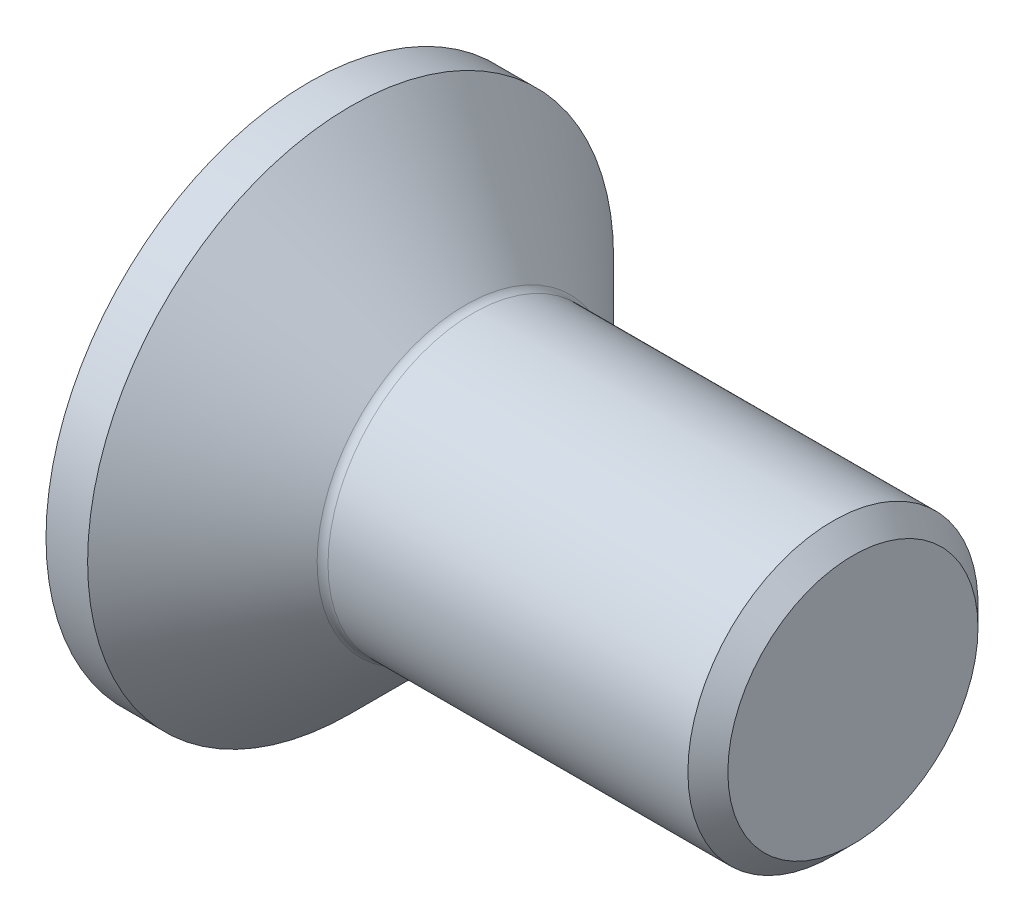
ISO-10303-21;
HEADER;
FILE_DESCRIPTION(('STEP AP214'),'2;1');
FILE_NAME('part.step','',(''),(''),'','','');
FILE_SCHEMA(('AUTOMOTIVE_DESIGN { 1 0 10303 214 1 1 1 1 }'));
ENDSEC;
DATA;
#1=APPLICATION_CONTEXT('core data for automotive mechanical design processes');
#2=APPLICATION_PROTOCOL_DEFINITION('international standard','automotive_design',2000,#1);
#3=PRODUCT_CONTEXT('',#1,'mechanical');
#4=PRODUCT('Part','Part','',(#3));
#5=PRODUCT_RELATED_PRODUCT_CATEGORY('part','',(#4));
#6=PRODUCT_DEFINITION_FORMATION('','',#4);
#7=PRODUCT_DEFINITION_CONTEXT('part definition',#1,'design');
#8=PRODUCT_DEFINITION('design','',#6,#7);
#9=PRODUCT_DEFINITION_SHAPE('','',#8);
#10=(LENGTH_UNIT() NAMED_UNIT(*) SI_UNIT(.MILLI.,.METRE.));
#11=(NAMED_UNIT(*) PLANE_ANGLE_UNIT() SI_UNIT($,.RADIAN.));
#12=(NAMED_UNIT(*) SI_UNIT($,.STERADIAN.) SOLID_ANGLE_UNIT());
#13=UNCERTAINTY_MEASURE_WITH_UNIT(LENGTH_MEASURE(1.E-05),#10,'distance_accuracy_value','');
#14=(GEOMETRIC_REPRESENTATION_CONTEXT(3) GLOBAL_UNCERTAINTY_ASSIGNED_CONTEXT((#13)) GLOBAL_UNIT_ASSIGNED_CONTEXT((#10,
#11,#12)) REPRESENTATION_CONTEXT('',''));
#15=CARTESIAN_POINT('',(0.,0.,0.));
#16=DIRECTION('',(0.,0.,1.));
#17=DIRECTION('',(1.,0.,0.));
#18=AXIS2_PLACEMENT_3D('',#15,#16,#17);
#19=CARTESIAN_POINT('',(0.,0.,0.));
#20=DIRECTION('',(-1.,0.,0.));
#21=DIRECTION('',(0.,0.,1.));
#22=AXIS2_PLACEMENT_3D('',#19,#20,#21);
#23=PLANE('',#22);
#24=CARTESIAN_POINT('',(0.,0.,0.));
#25=DIRECTION('',(-1.,0.,0.));
#26=DIRECTION('',(0.,0.,1.));
#27=AXIS2_PLACEMENT_3D('',#24,#25,#26);
#28=CIRCLE('',#27,14.505);
#29=CARTESIAN_POINT('',(0.,0.,14.505));
#30=VERTEX_POINT('',#29);
#31=EDGE_CURVE('E153',#30,#30,#28,.T.);
#32=ORIENTED_EDGE('',*,*,#31,.T.);
#33=EDGE_LOOP('',(#32));
#34=FACE_BOUND('',#33,.T.);
#35=DIRECTION('',(0.,-0.5,-0.866025403784439));
#36=VECTOR('',#35,1.);
#37=CARTESIAN_POINT('',(0.,-2.88675134594813,5.));
#38=LINE('',#37,#36);
#39=CARTESIAN_POINT('',(0.,-2.88675134594813,5.));
#40=VERTEX_POINT('',#39);
#41=CARTESIAN_POINT('',(0.,-5.77350269189626,0.));
#42=VERTEX_POINT('',#41);
#43=EDGE_CURVE('E119',#40,#42,#38,.T.);
#44=ORIENTED_EDGE('',*,*,#43,.T.);
#45=DIRECTION('',(0.,0.5,-0.866025403784439));
#46=VECTOR('',#45,1.);
#47=CARTESIAN_POINT('',(0.,-5.77350269189626,0.));
#48=LINE('',#47,#46);
#49=CARTESIAN_POINT('',(0.,-2.88675134594813,-5.));
#50=VERTEX_POINT('',#49);
#51=EDGE_CURVE('E50',#42,#50,#48,.T.);
#52=ORIENTED_EDGE('',*,*,#51,.T.);
#53=DIRECTION('',(0.,1.,0.));
#54=VECTOR('',#53,1.);
#55=CARTESIAN_POINT('',(0.,-2.88675134594813,-5.));
#56=LINE('',#55,#54);
#57=CARTESIAN_POINT('',(0.,2.88675134594813,-5.));
#58=VERTEX_POINT('',#57);
#59=EDGE_CURVE('E130',#50,#58,#56,.T.);
#60=ORIENTED_EDGE('',*,*,#59,.T.);
#61=DIRECTION('',(0.,0.5,0.866025403784439));
#62=VECTOR('',#61,1.);
#63=CARTESIAN_POINT('',(0.,2.88675134594813,-5.));
#64=LINE('',#63,#62);
#65=CARTESIAN_POINT('',(0.,5.77350269189626,0.));
#66=VERTEX_POINT('',#65);
#67=EDGE_CURVE('E254',#58,#66,#64,.T.);
#68=ORIENTED_EDGE('',*,*,#67,.T.);
#69=DIRECTION('',(0.,-0.5,0.866025403784439));
#70=VECTOR('',#69,1.);
#71=CARTESIAN_POINT('',(0.,5.77350269189626,0.));
#72=LINE('',#71,#70);
#73=CARTESIAN_POINT('',(0.,2.88675134594813,5.));
#74=VERTEX_POINT('',#73);
#75=EDGE_CURVE('E257',#66,#74,#72,.T.);
#76=ORIENTED_EDGE('',*,*,#75,.T.);
#77=DIRECTION('',(0.,-1.,0.));
#78=VECTOR('',#77,1.);
#79=CARTESIAN_POINT('',(0.,2.88675134594813,5.));
#80=LINE('',#79,#78);
#81=EDGE_CURVE('E260',#74,#40,#80,.T.);
#82=ORIENTED_EDGE('',*,*,#81,.T.);
#83=EDGE_LOOP('',(#44,#52,#60,#68,#76,#82));
#84=FACE_BOUND('',#83,.T.);
#85=ADVANCED_FACE('F35',(#34,#84),#23,.T.);
#86=CARTESIAN_POINT('',(0.,0.,0.));
#87=DIRECTION('',(-1.,0.,0.));
#88=DIRECTION('',(0.,0.,1.));
#89=AXIS2_PLACEMENT_3D('',#86,#87,#88);
#90=CYLINDRICAL_SURFACE('',#89,14.505);
#91=CARTESIAN_POINT('',(2.29500000000003,0.,0.));
#92=DIRECTION('',(-1.,0.,0.));
#93=DIRECTION('',(0.,0.,1.));
#94=AXIS2_PLACEMENT_3D('',#91,#92,#93);
#95=CIRCLE('',#94,14.505);
#96=CARTESIAN_POINT('',(2.29500000000003,0.,14.505));
#97=VERTEX_POINT('',#96);
#98=EDGE_CURVE('E150',#97,#97,#95,.T.);
#99=ORIENTED_EDGE('',*,*,#98,.T.);
#100=EDGE_LOOP('',(#99));
#101=FACE_BOUND('',#100,.T.);
#102=ORIENTED_EDGE('',*,*,#31,.F.);
#103=EDGE_LOOP('',(#102));
#104=FACE_BOUND('',#103,.T.);
#105=ADVANCED_FACE('F174',(#101,#104),#90,.T.);
#106=CARTESIAN_POINT('',(2.29500000000003,0.,0.));
#107=DIRECTION('',(-1.,0.,0.));
#108=DIRECTION('',(0.,0.,1.));
#109=AXIS2_PLACEMENT_3D('',#106,#107,#108);
#110=CONICAL_SURFACE('',#109,14.505,0.78539816339745);
#111=CARTESIAN_POINT('',(8.62426406871193,0.,0.));
#112=DIRECTION('',(-1.,0.,0.));
#113=DIRECTION('',(0.,0.,1.));
#114=AXIS2_PLACEMENT_3D('',#111,#112,#113);
#115=CIRCLE('',#114,8.17573593128808);
#116=CARTESIAN_POINT('',(8.62426406871193,0.,8.17573593128808));
#117=VERTEX_POINT('',#116);
#118=EDGE_CURVE('E43',#117,#117,#115,.T.);
#119=ORIENTED_EDGE('',*,*,#118,.T.);
#120=EDGE_LOOP('',(#119));
#121=FACE_BOUND('',#120,.T.);
#122=ORIENTED_EDGE('',*,*,#98,.F.);
#123=EDGE_LOOP('',(#122));
#124=FACE_BOUND('',#123,.T.);
#125=ADVANCED_FACE('F158',(#121,#124),#110,.T.);
#126=CARTESIAN_POINT('',(0.,0.,0.));
#127=DIRECTION('',(-1.,0.,0.));
#128=DIRECTION('',(0.,0.,1.));
#129=AXIS2_PLACEMENT_3D('',#126,#127,#128);
#130=CYLINDRICAL_SURFACE('',#129,8.);
#131=CARTESIAN_POINT('',(9.04852813742386,0.,0.));
#132=DIRECTION('',(-1.,0.,0.));
#133=DIRECTION('',(0.,0.,1.));
#134=AXIS2_PLACEMENT_3D('',#131,#132,#133);
#135=CIRCLE('',#134,8.);
#136=CARTESIAN_POINT('',(9.04852813742386,0.,8.));
#137=VERTEX_POINT('',#136);
#138=EDGE_CURVE('E11',#137,#137,#135,.F.);
#139=ORIENTED_EDGE('',*,*,#138,.T.);
#140=EDGE_LOOP('',(#139));
#141=FACE_BOUND('',#140,.T.);
#142=CARTESIAN_POINT('',(28.8985,0.,0.));
#143=DIRECTION('',(-1.,0.,0.));
#144=DIRECTION('',(0.,0.,1.));
#145=AXIS2_PLACEMENT_3D('',#142,#143,#144);
#146=CIRCLE('',#145,8.);
#147=CARTESIAN_POINT('',(28.8985,0.,8.));
#148=VERTEX_POINT('',#147);
#149=EDGE_CURVE('E147',#148,#148,#146,.T.);
#150=ORIENTED_EDGE('',*,*,#149,.T.);
#151=EDGE_LOOP('',(#150));
#152=FACE_BOUND('',#151,.T.);
#153=ADVANCED_FACE('F185',(#141,#152),#130,.T.);
#154=CARTESIAN_POINT('',(30.,0.,0.));
#155=DIRECTION('',(-1.,0.,0.));
#156=DIRECTION('',(0.,0.,1.));
#157=AXIS2_PLACEMENT_3D('',#154,#155,#156);
#158=CONICAL_SURFACE('',#157,6.8985,0.78539816339747);
#159=ORIENTED_EDGE('',*,*,#149,.F.);
#160=EDGE_LOOP('',(#159));
#161=FACE_BOUND('',#160,.T.);
#162=CARTESIAN_POINT('',(30.,0.,0.));
#163=DIRECTION('',(-1.,0.,0.));
#164=DIRECTION('',(0.,0.,1.));
#165=AXIS2_PLACEMENT_3D('',#162,#163,#164);
#166=CIRCLE('',#165,6.8985);
#167=CARTESIAN_POINT('',(30.,0.,6.8985));
#168=VERTEX_POINT('',#167);
#169=EDGE_CURVE('E143',#168,#168,#166,.T.);
#170=ORIENTED_EDGE('',*,*,#169,.T.);
#171=EDGE_LOOP('',(#170));
#172=FACE_BOUND('',#171,.T.);
#173=ADVANCED_FACE('F169',(#161,#172),#158,.T.);
#174=CARTESIAN_POINT('',(30.,6.8985,0.));
#175=DIRECTION('',(1.,0.,0.));
#176=DIRECTION('',(0.,0.,-1.));
#177=AXIS2_PLACEMENT_3D('',#174,#175,#176);
#178=PLANE('',#177);
#179=ORIENTED_EDGE('',*,*,#169,.F.);
#180=EDGE_LOOP('',(#179));
#181=FACE_BOUND('',#180,.T.);
#182=ADVANCED_FACE('F162',(#181),#178,.T.);
#183=CARTESIAN_POINT('',(9.04852813742386,0.,0.));
#184=DIRECTION('',(-1.,0.,0.));
#185=DIRECTION('',(0.,0.,1.));
#186=AXIS2_PLACEMENT_3D('',#183,#184,#185);
#187=TOROIDAL_SURFACE('',#186,8.6,0.6);
#188=ORIENTED_EDGE('',*,*,#138,.F.);
#189=EDGE_LOOP('',(#188));
#190=FACE_BOUND('',#189,.T.);
#191=ORIENTED_EDGE('',*,*,#118,.F.);
#192=EDGE_LOOP('',(#191));
#193=FACE_BOUND('',#192,.T.);
#194=ADVANCED_FACE('F37',(#190,#193),#187,.F.);
#195=CARTESIAN_POINT('',(4.8,-5.77350269189626,0.));
#196=DIRECTION('',(0.,0.866025403784439,0.5));
#197=DIRECTION('',(0.,-0.5,0.866025403784439));
#198=AXIS2_PLACEMENT_3D('',#195,#196,#197);
#199=PLANE('',#198);
#200=ORIENTED_EDGE('',*,*,#51,.F.);
#201=DIRECTION('',(-1.,0.,0.));
#202=VECTOR('',#201,1.);
#203=CARTESIAN_POINT('',(4.8,-5.77350269189626,0.));
#204=LINE('',#203,#202);
#205=CARTESIAN_POINT('',(4.8,-5.77350269189626,0.));
#206=VERTEX_POINT('',#205);
#207=EDGE_CURVE('E251',#206,#42,#204,.T.);
#208=ORIENTED_EDGE('',*,*,#207,.F.);
#209=DIRECTION('',(0.,0.5,-0.866025403784439));
#210=VECTOR('',#209,1.);
#211=CARTESIAN_POINT('',(4.8,-5.77350269189626,0.));
#212=LINE('',#211,#210);
#213=CARTESIAN_POINT('',(4.8,-4.33012701892219,-2.5));
#214=VERTEX_POINT('',#213);
#215=EDGE_CURVE('E115',#206,#214,#212,.T.);
#216=ORIENTED_EDGE('',*,*,#215,.T.);
#217=CARTESIAN_POINT('',(4.8,-2.88675134594813,-5.));
#218=VERTEX_POINT('',#217);
#219=EDGE_CURVE('E111',#214,#218,#212,.T.);
#220=ORIENTED_EDGE('',*,*,#219,.T.);
#221=DIRECTION('',(-1.,0.,0.));
#222=VECTOR('',#221,1.);
#223=CARTESIAN_POINT('',(4.8,-2.88675134594813,-5.));
#224=LINE('',#223,#222);
#225=EDGE_CURVE('E113',#218,#50,#224,.T.);
#226=ORIENTED_EDGE('',*,*,#225,.T.);
#227=EDGE_LOOP('',(#200,#208,#216,#220,#226));
#228=FACE_BOUND('',#227,.T.);
#229=ADVANCED_FACE('F112',(#228),#199,.T.);
#230=CARTESIAN_POINT('',(4.8,-2.88675134594813,-5.));
#231=DIRECTION('',(0.,0.,1.));
#232=DIRECTION('',(1.,0.,0.));
#233=AXIS2_PLACEMENT_3D('',#230,#231,#232);
#234=PLANE('',#233);
#235=ORIENTED_EDGE('',*,*,#59,.F.);
#236=ORIENTED_EDGE('',*,*,#225,.F.);
#237=DIRECTION('',(0.,1.,0.));
#238=VECTOR('',#237,1.);
#239=CARTESIAN_POINT('',(4.8,-2.88675134594813,-5.));
#240=LINE('',#239,#238);
#241=CARTESIAN_POINT('',(4.8,0.,-5.));
#242=VERTEX_POINT('',#241);
#243=EDGE_CURVE('E58',#218,#242,#240,.T.);
#244=ORIENTED_EDGE('',*,*,#243,.T.);
#245=CARTESIAN_POINT('',(4.8,2.88675134594813,-5.));
#246=VERTEX_POINT('',#245);
#247=EDGE_CURVE('E125',#242,#246,#240,.T.);
#248=ORIENTED_EDGE('',*,*,#247,.T.);
#249=DIRECTION('',(-1.,0.,0.));
#250=VECTOR('',#249,1.);
#251=CARTESIAN_POINT('',(4.8,2.88675134594813,-5.));
#252=LINE('',#251,#250);
#253=EDGE_CURVE('E132',#246,#58,#252,.T.);
#254=ORIENTED_EDGE('',*,*,#253,.T.);
#255=EDGE_LOOP('',(#235,#236,#244,#248,#254));
#256=FACE_BOUND('',#255,.T.);
#257=ADVANCED_FACE('F127',(#256),#234,.T.);
#258=CARTESIAN_POINT('',(4.8,2.88675134594813,-5.));
#259=DIRECTION('',(0.,-0.866025403784439,0.5));
#260=DIRECTION('',(0.,-0.5,-0.866025403784439));
#261=AXIS2_PLACEMENT_3D('',#258,#259,#260);
#262=PLANE('',#261);
#263=ORIENTED_EDGE('',*,*,#67,.F.);
#264=ORIENTED_EDGE('',*,*,#253,.F.);
#265=DIRECTION('',(0.,0.5,0.866025403784439));
#266=VECTOR('',#265,1.);
#267=CARTESIAN_POINT('',(4.8,2.88675134594813,-5.));
#268=LINE('',#267,#266);
#269=CARTESIAN_POINT('',(4.8,4.33012701892219,-2.5));
#270=VERTEX_POINT('',#269);
#271=EDGE_CURVE('E232',#246,#270,#268,.T.);
#272=ORIENTED_EDGE('',*,*,#271,.T.);
#273=CARTESIAN_POINT('',(4.8,5.77350269189626,0.));
#274=VERTEX_POINT('',#273);
#275=EDGE_CURVE('E124',#270,#274,#268,.T.);
#276=ORIENTED_EDGE('',*,*,#275,.T.);
#277=DIRECTION('',(-1.,0.,0.));
#278=VECTOR('',#277,1.);
#279=CARTESIAN_POINT('',(4.8,5.77350269189626,0.));
#280=LINE('',#279,#278);
#281=EDGE_CURVE('E138',#274,#66,#280,.T.);
#282=ORIENTED_EDGE('',*,*,#281,.T.);
#283=EDGE_LOOP('',(#263,#264,#272,#276,#282));
#284=FACE_BOUND('',#283,.T.);
#285=ADVANCED_FACE('F199',(#284),#262,.T.);
#286=CARTESIAN_POINT('',(4.8,5.77350269189626,0.));
#287=DIRECTION('',(0.,-0.866025403784439,-0.5));
#288=DIRECTION('',(0.,0.5,-0.866025403784439));
#289=AXIS2_PLACEMENT_3D('',#286,#287,#288);
#290=PLANE('',#289);
#291=ORIENTED_EDGE('',*,*,#75,.F.);
#292=ORIENTED_EDGE('',*,*,#281,.F.);
#293=DIRECTION('',(0.,-0.5,0.866025403784439));
#294=VECTOR('',#293,1.);
#295=CARTESIAN_POINT('',(4.8,5.77350269189626,0.));
#296=LINE('',#295,#294);
#297=CARTESIAN_POINT('',(4.8,4.33012701892219,2.5));
#298=VERTEX_POINT('',#297);
#299=EDGE_CURVE('E239',#274,#298,#296,.T.);
#300=ORIENTED_EDGE('',*,*,#299,.T.);
#301=CARTESIAN_POINT('',(4.8,2.88675134594813,5.));
#302=VERTEX_POINT('',#301);
#303=EDGE_CURVE('E237',#298,#302,#296,.T.);
#304=ORIENTED_EDGE('',*,*,#303,.T.);
#305=DIRECTION('',(-1.,0.,0.));
#306=VECTOR('',#305,1.);
#307=CARTESIAN_POINT('',(4.8,2.88675134594813,5.));
#308=LINE('',#307,#306);
#309=EDGE_CURVE('E269',#302,#74,#308,.T.);
#310=ORIENTED_EDGE('',*,*,#309,.T.);
#311=EDGE_LOOP('',(#291,#292,#300,#304,#310));
#312=FACE_BOUND('',#311,.T.);
#313=ADVANCED_FACE('F202',(#312),#290,.T.);
#314=CARTESIAN_POINT('',(4.8,2.88675134594813,5.));
#315=DIRECTION('',(0.,0.,-1.));
#316=DIRECTION('',(0.,1.,0.));
#317=AXIS2_PLACEMENT_3D('',#314,#315,#316);
#318=PLANE('',#317);
#319=ORIENTED_EDGE('',*,*,#81,.F.);
#320=ORIENTED_EDGE('',*,*,#309,.F.);
#321=DIRECTION('',(0.,-1.,0.));
#322=VECTOR('',#321,1.);
#323=CARTESIAN_POINT('',(4.8,2.88675134594813,5.));
#324=LINE('',#323,#322);
#325=CARTESIAN_POINT('',(4.8,0.,5.));
#326=VERTEX_POINT('',#325);
#327=EDGE_CURVE('E244',#302,#326,#324,.T.);
#328=ORIENTED_EDGE('',*,*,#327,.T.);
#329=CARTESIAN_POINT('',(4.8,-2.88675134594813,5.));
#330=VERTEX_POINT('',#329);
#331=EDGE_CURVE('E243',#326,#330,#324,.T.);
#332=ORIENTED_EDGE('',*,*,#331,.T.);
#333=DIRECTION('',(-1.,0.,0.));
#334=VECTOR('',#333,1.);
#335=CARTESIAN_POINT('',(4.8,-2.88675134594813,5.));
#336=LINE('',#335,#334);
#337=EDGE_CURVE('E266',#330,#40,#336,.T.);
#338=ORIENTED_EDGE('',*,*,#337,.T.);
#339=EDGE_LOOP('',(#319,#320,#328,#332,#338));
#340=FACE_BOUND('',#339,.T.);
#341=ADVANCED_FACE('F206',(#340),#318,.T.);
#342=CARTESIAN_POINT('',(4.8,-2.88675134594813,5.));
#343=DIRECTION('',(0.,0.866025403784439,-0.5));
#344=DIRECTION('',(0.,0.5,0.866025403784439));
#345=AXIS2_PLACEMENT_3D('',#342,#343,#344);
#346=PLANE('',#345);
#347=ORIENTED_EDGE('',*,*,#43,.F.);
#348=ORIENTED_EDGE('',*,*,#337,.F.);
#349=DIRECTION('',(0.,-0.5,-0.866025403784439));
#350=VECTOR('',#349,1.);
#351=CARTESIAN_POINT('',(4.8,-2.88675134594813,5.));
#352=LINE('',#351,#350);
#353=CARTESIAN_POINT('',(4.8,-4.33012701892219,2.5));
#354=VERTEX_POINT('',#353);
#355=EDGE_CURVE('E248',#330,#354,#352,.T.);
#356=ORIENTED_EDGE('',*,*,#355,.T.);
#357=EDGE_CURVE('E247',#354,#206,#352,.T.);
#358=ORIENTED_EDGE('',*,*,#357,.T.);
#359=ORIENTED_EDGE('',*,*,#207,.T.);
#360=EDGE_LOOP('',(#347,#348,#356,#358,#359));
#361=FACE_BOUND('',#360,.T.);
#362=ADVANCED_FACE('F210',(#361),#346,.T.);
#363=CARTESIAN_POINT('',(4.8,-2.88675134594813,-5.));
#364=DIRECTION('',(1.,0.,0.));
#365=DIRECTION('',(0.,0.,-1.));
#366=AXIS2_PLACEMENT_3D('',#363,#364,#365);
#367=PLANE('',#366);
#368=ORIENTED_EDGE('',*,*,#243,.F.);
#369=ORIENTED_EDGE('',*,*,#219,.F.);
#370=CARTESIAN_POINT('',(4.8,0.,0.));
#371=DIRECTION('',(-1.,0.,0.));
#372=DIRECTION('',(0.,0.,1.));
#373=AXIS2_PLACEMENT_3D('',#370,#371,#372);
#374=CIRCLE('',#373,5.);
#375=EDGE_CURVE('E122',#242,#214,#374,.T.);
#376=ORIENTED_EDGE('',*,*,#375,.F.);
#377=EDGE_LOOP('',(#368,#369,#376));
#378=FACE_BOUND('',#377,.T.);
#379=ADVANCED_FACE('F121',(#378),#367,.F.);
#380=ORIENTED_EDGE('',*,*,#215,.F.);
#381=ORIENTED_EDGE('',*,*,#357,.F.);
#382=EDGE_CURVE('E135',#214,#354,#374,.T.);
#383=ORIENTED_EDGE('',*,*,#382,.F.);
#384=EDGE_LOOP('',(#380,#381,#383));
#385=FACE_BOUND('',#384,.T.);
#386=ADVANCED_FACE('F216',(#385),#367,.F.);
#387=ORIENTED_EDGE('',*,*,#355,.F.);
#388=ORIENTED_EDGE('',*,*,#331,.F.);
#389=EDGE_CURVE('E131',#354,#326,#374,.T.);
#390=ORIENTED_EDGE('',*,*,#389,.F.);
#391=EDGE_LOOP('',(#387,#388,#390));
#392=FACE_BOUND('',#391,.T.);
#393=ADVANCED_FACE('F220',(#392),#367,.F.);
#394=ORIENTED_EDGE('',*,*,#327,.F.);
#395=ORIENTED_EDGE('',*,*,#303,.F.);
#396=EDGE_CURVE('E137',#326,#298,#374,.T.);
#397=ORIENTED_EDGE('',*,*,#396,.F.);
#398=EDGE_LOOP('',(#394,#395,#397));
#399=FACE_BOUND('',#398,.T.);
#400=ADVANCED_FACE('F228',(#399),#367,.F.);
#401=ORIENTED_EDGE('',*,*,#299,.F.);
#402=ORIENTED_EDGE('',*,*,#275,.F.);
#403=EDGE_CURVE('E144',#298,#270,#374,.T.);
#404=ORIENTED_EDGE('',*,*,#403,.F.);
#405=EDGE_LOOP('',(#401,#402,#404));
#406=FACE_BOUND('',#405,.T.);
#407=ADVANCED_FACE('F223',(#406),#367,.F.);
#408=ORIENTED_EDGE('',*,*,#271,.F.);
#409=ORIENTED_EDGE('',*,*,#247,.F.);
#410=EDGE_CURVE('E233',#270,#242,#374,.T.);
#411=ORIENTED_EDGE('',*,*,#410,.F.);
#412=EDGE_LOOP('',(#408,#409,#411));
#413=FACE_BOUND('',#412,.T.);
#414=ADVANCED_FACE('F194',(#413),#367,.F.);
#415=CARTESIAN_POINT('',(4.8,0.,0.));
#416=DIRECTION('',(-1.,0.,0.));
#417=DIRECTION('',(0.,0.,1.));
#418=AXIS2_PLACEMENT_3D('',#415,#416,#417);
#419=CONICAL_SURFACE('',#418,5.,1.04719755119659);
#420=CARTESIAN_POINT('',(7.68675134594816,0.,0.));
#421=VERTEX_POINT('',#420);
#422=VERTEX_LOOP('',#421);
#423=FACE_BOUND('',#422,.T.);
#424=ORIENTED_EDGE('',*,*,#396,.T.);
#425=ORIENTED_EDGE('',*,*,#403,.T.);
#426=ORIENTED_EDGE('',*,*,#410,.T.);
#427=ORIENTED_EDGE('',*,*,#375,.T.);
#428=ORIENTED_EDGE('',*,*,#382,.T.);
#429=ORIENTED_EDGE('',*,*,#389,.T.);
#430=EDGE_LOOP('',(#424,#425,#426,#427,#428,#429));
#431=FACE_BOUND('',#430,.T.);
#432=ADVANCED_FACE('F192',(#423,#431),#419,.F.);
#433=CLOSED_SHELL('',(#85,#105,#125,#153,#173,#182,#194,#229,#257,#285,#313,#341,#362,#379,#386,
#393,#400,#407,#414,#432));
#434=MANIFOLD_SOLID_BREP('B2',#433);
#435=ADVANCED_BREP_SHAPE_REPRESENTATION('',(#18,#434),#14);
#436=SHAPE_DEFINITION_REPRESENTATION(#9,#435);
ENDSEC;
END-ISO-10303-21;
